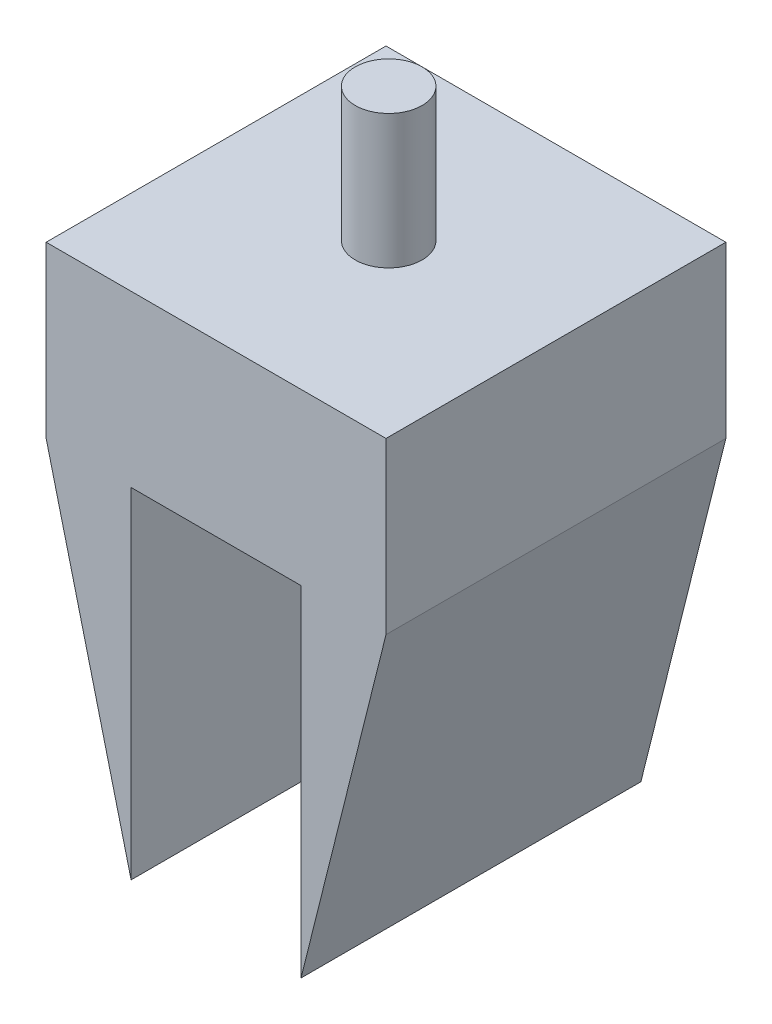
ISO-10303-21;
HEADER;
FILE_DESCRIPTION(('STEP AP214'),'2;1');
FILE_NAME('part.step','',(''),(''),'','','');
FILE_SCHEMA(('AUTOMOTIVE_DESIGN { 1 0 10303 214 1 1 1 1 }'));
ENDSEC;
DATA;
#1=APPLICATION_CONTEXT('core data for automotive mechanical design processes');
#2=APPLICATION_PROTOCOL_DEFINITION('international standard','automotive_design',2000,#1);
#3=PRODUCT_CONTEXT('',#1,'mechanical');
#4=PRODUCT('Part','Part','',(#3));
#5=PRODUCT_RELATED_PRODUCT_CATEGORY('part','',(#4));
#6=PRODUCT_DEFINITION_FORMATION('','',#4);
#7=PRODUCT_DEFINITION_CONTEXT('part definition',#1,'design');
#8=PRODUCT_DEFINITION('design','',#6,#7);
#9=PRODUCT_DEFINITION_SHAPE('','',#8);
#10=(LENGTH_UNIT() NAMED_UNIT(*) SI_UNIT(.MILLI.,.METRE.));
#11=(NAMED_UNIT(*) PLANE_ANGLE_UNIT() SI_UNIT($,.RADIAN.));
#12=(NAMED_UNIT(*) SI_UNIT($,.STERADIAN.) SOLID_ANGLE_UNIT());
#13=UNCERTAINTY_MEASURE_WITH_UNIT(LENGTH_MEASURE(1.E-05),#10,'distance_accuracy_value','');
#14=(GEOMETRIC_REPRESENTATION_CONTEXT(3) GLOBAL_UNCERTAINTY_ASSIGNED_CONTEXT((#13)) GLOBAL_UNIT_ASSIGNED_CONTEXT((#10,
#11,#12)) REPRESENTATION_CONTEXT('',''));
#15=CARTESIAN_POINT('',(0.,0.,0.));
#16=DIRECTION('',(0.,0.,1.));
#17=DIRECTION('',(1.,0.,0.));
#18=AXIS2_PLACEMENT_3D('',#15,#16,#17);
#19=CARTESIAN_POINT('',(0.,0.,-50.8));
#20=DIRECTION('',(-1.,0.,0.));
#21=DIRECTION('',(0.,0.,1.));
#22=AXIS2_PLACEMENT_3D('',#19,#20,#21);
#23=PLANE('',#22);
#24=DIRECTION('',(0.,0.,1.));
#25=VECTOR('',#24,1.);
#26=CARTESIAN_POINT('',(0.,50.8,-63.5));
#27=LINE('',#26,#25);
#28=CARTESIAN_POINT('',(0.,50.8,-50.8));
#29=VERTEX_POINT('',#28);
#30=CARTESIAN_POINT('',(0.,50.8,0.));
#31=VERTEX_POINT('',#30);
#32=EDGE_CURVE('E185',#29,#31,#27,.T.);
#33=ORIENTED_EDGE('',*,*,#32,.T.);
#34=DIRECTION('',(0.,-1.,0.));
#35=VECTOR('',#34,1.);
#36=CARTESIAN_POINT('',(0.,0.,0.));
#37=LINE('',#36,#35);
#38=CARTESIAN_POINT('',(0.,76.2,0.));
#39=VERTEX_POINT('',#38);
#40=EDGE_CURVE('E155',#39,#31,#37,.T.);
#41=ORIENTED_EDGE('',*,*,#40,.F.);
#42=DIRECTION('',(0.,0.,1.));
#43=VECTOR('',#42,1.);
#44=CARTESIAN_POINT('',(0.,76.2,-50.8));
#45=LINE('',#44,#43);
#46=CARTESIAN_POINT('',(0.,76.2,-50.8));
#47=VERTEX_POINT('',#46);
#48=EDGE_CURVE('E11',#47,#39,#45,.T.);
#49=ORIENTED_EDGE('',*,*,#48,.F.);
#50=DIRECTION('',(0.,-1.,0.));
#51=VECTOR('',#50,1.);
#52=CARTESIAN_POINT('',(0.,0.,-50.8));
#53=LINE('',#52,#51);
#54=EDGE_CURVE('E169',#47,#29,#53,.T.);
#55=ORIENTED_EDGE('',*,*,#54,.T.);
#56=EDGE_LOOP('',(#33,#41,#49,#55));
#57=FACE_BOUND('',#56,.T.);
#58=ADVANCED_FACE('F45',(#57),#23,.T.);
#59=CARTESIAN_POINT('',(0.,76.2,-50.8));
#60=DIRECTION('',(0.,1.,0.));
#61=DIRECTION('',(0.,0.,1.));
#62=AXIS2_PLACEMENT_3D('',#59,#60,#61);
#63=PLANE('',#62);
#64=CARTESIAN_POINT('',(25.4,76.2,-25.8));
#65=DIRECTION('',(0.,1.,0.));
#66=DIRECTION('',(0.,0.,1.));
#67=AXIS2_PLACEMENT_3D('',#64,#65,#66);
#68=CIRCLE('',#67,5.);
#69=CARTESIAN_POINT('',(25.4,76.2,-20.8));
#70=VERTEX_POINT('',#69);
#71=EDGE_CURVE('E313',#70,#70,#68,.T.);
#72=ORIENTED_EDGE('',*,*,#71,.F.);
#73=EDGE_LOOP('',(#72));
#74=FACE_BOUND('',#73,.T.);
#75=DIRECTION('',(-1.,0.,0.));
#76=VECTOR('',#75,1.);
#77=CARTESIAN_POINT('',(0.,76.2,0.));
#78=LINE('',#77,#76);
#79=CARTESIAN_POINT('',(50.8,76.2,0.));
#80=VERTEX_POINT('',#79);
#81=EDGE_CURVE('E147',#80,#39,#78,.T.);
#82=ORIENTED_EDGE('',*,*,#81,.F.);
#83=DIRECTION('',(0.,0.,1.));
#84=VECTOR('',#83,1.);
#85=CARTESIAN_POINT('',(50.8,76.2,-50.8));
#86=LINE('',#85,#84);
#87=CARTESIAN_POINT('',(50.8,76.2,-50.8));
#88=VERTEX_POINT('',#87);
#89=EDGE_CURVE('E55',#88,#80,#86,.T.);
#90=ORIENTED_EDGE('',*,*,#89,.F.);
#91=DIRECTION('',(-1.,0.,0.));
#92=VECTOR('',#91,1.);
#93=CARTESIAN_POINT('',(0.,76.2,-50.8));
#94=LINE('',#93,#92);
#95=EDGE_CURVE('E174',#88,#47,#94,.T.);
#96=ORIENTED_EDGE('',*,*,#95,.T.);
#97=ORIENTED_EDGE('',*,*,#48,.T.);
#98=EDGE_LOOP('',(#82,#90,#96,#97));
#99=FACE_BOUND('',#98,.T.);
#100=ADVANCED_FACE('F206',(#74,#99),#63,.T.);
#101=CARTESIAN_POINT('',(50.8,76.2,-50.8));
#102=DIRECTION('',(1.,0.,0.));
#103=DIRECTION('',(0.,0.,-1.));
#104=AXIS2_PLACEMENT_3D('',#101,#102,#103);
#105=PLANE('',#104);
#106=DIRECTION('',(0.,0.,1.));
#107=VECTOR('',#106,1.);
#108=CARTESIAN_POINT('',(50.8,50.8,-63.5));
#109=LINE('',#108,#107);
#110=CARTESIAN_POINT('',(50.8,50.8,-50.8));
#111=VERTEX_POINT('',#110);
#112=CARTESIAN_POINT('',(50.8000000000001,50.8000000000005,0.));
#113=VERTEX_POINT('',#112);
#114=EDGE_CURVE('E63',#111,#113,#109,.T.);
#115=ORIENTED_EDGE('',*,*,#114,.F.);
#116=DIRECTION('',(0.,1.,0.));
#117=VECTOR('',#116,1.);
#118=CARTESIAN_POINT('',(50.8,76.2,-50.8));
#119=LINE('',#118,#117);
#120=EDGE_CURVE('E179',#111,#88,#119,.T.);
#121=ORIENTED_EDGE('',*,*,#120,.T.);
#122=ORIENTED_EDGE('',*,*,#89,.T.);
#123=DIRECTION('',(0.,1.,0.));
#124=VECTOR('',#123,1.);
#125=CARTESIAN_POINT('',(50.8,76.2,0.));
#126=LINE('',#125,#124);
#127=EDGE_CURVE('E143',#113,#80,#126,.T.);
#128=ORIENTED_EDGE('',*,*,#127,.F.);
#129=EDGE_LOOP('',(#115,#121,#122,#128));
#130=FACE_BOUND('',#129,.T.);
#131=ADVANCED_FACE('F203',(#130),#105,.T.);
#132=CARTESIAN_POINT('',(38.1,0.,-50.8));
#133=DIRECTION('',(-1.,0.,0.));
#134=DIRECTION('',(0.,0.,1.));
#135=AXIS2_PLACEMENT_3D('',#132,#133,#134);
#136=PLANE('',#135);
#137=DIRECTION('',(0.,-1.,0.));
#138=VECTOR('',#137,1.);
#139=CARTESIAN_POINT('',(38.1,0.,0.));
#140=LINE('',#139,#138);
#141=CARTESIAN_POINT('',(38.1,50.8,0.));
#142=VERTEX_POINT('',#141);
#143=CARTESIAN_POINT('',(38.1,0.,0.));
#144=VERTEX_POINT('',#143);
#145=EDGE_CURVE('E132',#142,#144,#140,.T.);
#146=ORIENTED_EDGE('',*,*,#145,.F.);
#147=DIRECTION('',(0.,0.,1.));
#148=VECTOR('',#147,1.);
#149=CARTESIAN_POINT('',(38.1,50.8,-50.8));
#150=LINE('',#149,#148);
#151=CARTESIAN_POINT('',(38.1,50.8,-50.8));
#152=VERTEX_POINT('',#151);
#153=EDGE_CURVE('E137',#152,#142,#150,.T.);
#154=ORIENTED_EDGE('',*,*,#153,.F.);
#155=DIRECTION('',(0.,-1.,0.));
#156=VECTOR('',#155,1.);
#157=CARTESIAN_POINT('',(38.1,0.,-50.8));
#158=LINE('',#157,#156);
#159=CARTESIAN_POINT('',(38.1,0.,-50.8));
#160=VERTEX_POINT('',#159);
#161=EDGE_CURVE('E135',#152,#160,#158,.T.);
#162=ORIENTED_EDGE('',*,*,#161,.T.);
#163=DIRECTION('',(0.,0.,1.));
#164=VECTOR('',#163,1.);
#165=CARTESIAN_POINT('',(38.1,0.,-50.8));
#166=LINE('',#165,#164);
#167=EDGE_CURVE('E120',#160,#144,#166,.T.);
#168=ORIENTED_EDGE('',*,*,#167,.T.);
#169=EDGE_LOOP('',(#146,#154,#162,#168));
#170=FACE_BOUND('',#169,.T.);
#171=ADVANCED_FACE('F131',(#170),#136,.T.);
#172=CARTESIAN_POINT('',(38.1,50.8,-50.8));
#173=DIRECTION('',(0.,-1.,0.));
#174=DIRECTION('',(0.,0.,-1.));
#175=AXIS2_PLACEMENT_3D('',#172,#173,#174);
#176=PLANE('',#175);
#177=DIRECTION('',(1.,0.,0.));
#178=VECTOR('',#177,1.);
#179=CARTESIAN_POINT('',(38.1,50.8,0.));
#180=LINE('',#179,#178);
#181=CARTESIAN_POINT('',(12.7,50.8,0.));
#182=VERTEX_POINT('',#181);
#183=EDGE_CURVE('E141',#182,#142,#180,.T.);
#184=ORIENTED_EDGE('',*,*,#183,.F.);
#185=DIRECTION('',(0.,0.,1.));
#186=VECTOR('',#185,1.);
#187=CARTESIAN_POINT('',(12.7,50.8,-50.8));
#188=LINE('',#187,#186);
#189=CARTESIAN_POINT('',(12.7,50.8,-50.8));
#190=VERTEX_POINT('',#189);
#191=EDGE_CURVE('E99',#190,#182,#188,.T.);
#192=ORIENTED_EDGE('',*,*,#191,.F.);
#193=DIRECTION('',(1.,0.,0.));
#194=VECTOR('',#193,1.);
#195=CARTESIAN_POINT('',(38.1,50.8,-50.8));
#196=LINE('',#195,#194);
#197=EDGE_CURVE('E195',#190,#152,#196,.T.);
#198=ORIENTED_EDGE('',*,*,#197,.T.);
#199=ORIENTED_EDGE('',*,*,#153,.T.);
#200=EDGE_LOOP('',(#184,#192,#198,#199));
#201=FACE_BOUND('',#200,.T.);
#202=ADVANCED_FACE('F210',(#201),#176,.T.);
#203=CARTESIAN_POINT('',(12.7,50.8,-50.8));
#204=DIRECTION('',(1.,0.,0.));
#205=DIRECTION('',(0.,0.,-1.));
#206=AXIS2_PLACEMENT_3D('',#203,#204,#205);
#207=PLANE('',#206);
#208=DIRECTION('',(0.,1.,0.));
#209=VECTOR('',#208,1.);
#210=CARTESIAN_POINT('',(12.7,50.8,0.));
#211=LINE('',#210,#209);
#212=CARTESIAN_POINT('',(12.7,0.,0.));
#213=VERTEX_POINT('',#212);
#214=EDGE_CURVE('E149',#213,#182,#211,.T.);
#215=ORIENTED_EDGE('',*,*,#214,.F.);
#216=DIRECTION('',(0.,0.,1.));
#217=VECTOR('',#216,1.);
#218=CARTESIAN_POINT('',(12.7,0.,-50.8));
#219=LINE('',#218,#217);
#220=CARTESIAN_POINT('',(12.7,0.,-50.8));
#221=VERTEX_POINT('',#220);
#222=EDGE_CURVE('E49',#221,#213,#219,.T.);
#223=ORIENTED_EDGE('',*,*,#222,.F.);
#224=DIRECTION('',(0.,1.,0.));
#225=VECTOR('',#224,1.);
#226=CARTESIAN_POINT('',(12.7,50.8,-50.8));
#227=LINE('',#226,#225);
#228=EDGE_CURVE('E158',#221,#190,#227,.T.);
#229=ORIENTED_EDGE('',*,*,#228,.T.);
#230=ORIENTED_EDGE('',*,*,#191,.T.);
#231=EDGE_LOOP('',(#215,#223,#229,#230));
#232=FACE_BOUND('',#231,.T.);
#233=ADVANCED_FACE('F47',(#232),#207,.T.);
#234=CARTESIAN_POINT('',(0.,0.,-50.8));
#235=DIRECTION('',(0.,0.,-1.));
#236=DIRECTION('',(-1.,0.,0.));
#237=AXIS2_PLACEMENT_3D('',#234,#235,#236);
#238=PLANE('',#237);
#239=DIRECTION('',(0.242535625036333,0.970142500145332,0.));
#240=VECTOR('',#239,1.);
#241=CARTESIAN_POINT('',(35.8588235294118,-8.96470588235294,-50.8));
#242=LINE('',#241,#240);
#243=EDGE_CURVE('E321',#160,#111,#242,.T.);
#244=ORIENTED_EDGE('',*,*,#243,.F.);
#245=ORIENTED_EDGE('',*,*,#161,.F.);
#246=ORIENTED_EDGE('',*,*,#197,.F.);
#247=ORIENTED_EDGE('',*,*,#228,.F.);
#248=DIRECTION('',(0.242535625036333,-0.970142500145332,0.));
#249=VECTOR('',#248,1.);
#250=CARTESIAN_POINT('',(11.9529411764706,2.98823529411765,-50.8));
#251=LINE('',#250,#249);
#252=EDGE_CURVE('E183',#29,#221,#251,.T.);
#253=ORIENTED_EDGE('',*,*,#252,.F.);
#254=ORIENTED_EDGE('',*,*,#54,.F.);
#255=ORIENTED_EDGE('',*,*,#95,.F.);
#256=ORIENTED_EDGE('',*,*,#120,.F.);
#257=EDGE_LOOP('',(#244,#245,#246,#247,#253,#254,#255,#256));
#258=FACE_BOUND('',#257,.T.);
#259=ADVANCED_FACE('F207',(#258),#238,.T.);
#260=CARTESIAN_POINT('',(0.,0.,0.));
#261=DIRECTION('',(0.,0.,-1.));
#262=DIRECTION('',(-1.,0.,0.));
#263=AXIS2_PLACEMENT_3D('',#260,#261,#262);
#264=PLANE('',#263);
#265=ORIENTED_EDGE('',*,*,#145,.T.);
#266=DIRECTION('',(-0.242535625036333,-0.970142500145332,0.));
#267=VECTOR('',#266,1.);
#268=CARTESIAN_POINT('',(50.8,50.8,0.));
#269=LINE('',#268,#267);
#270=EDGE_CURVE('E117',#113,#144,#269,.T.);
#271=ORIENTED_EDGE('',*,*,#270,.F.);
#272=ORIENTED_EDGE('',*,*,#127,.T.);
#273=ORIENTED_EDGE('',*,*,#81,.T.);
#274=ORIENTED_EDGE('',*,*,#40,.T.);
#275=DIRECTION('',(-0.242535625036333,0.970142500145332,0.));
#276=VECTOR('',#275,1.);
#277=CARTESIAN_POINT('',(0.,50.8,0.));
#278=LINE('',#277,#276);
#279=EDGE_CURVE('E189',#213,#31,#278,.T.);
#280=ORIENTED_EDGE('',*,*,#279,.F.);
#281=ORIENTED_EDGE('',*,*,#214,.T.);
#282=ORIENTED_EDGE('',*,*,#183,.T.);
#283=EDGE_LOOP('',(#265,#271,#272,#273,#274,#280,#281,#282));
#284=FACE_BOUND('',#283,.T.);
#285=ADVANCED_FACE('F139',(#284),#264,.F.);
#286=CARTESIAN_POINT('',(0.,50.8,-63.5));
#287=DIRECTION('',(0.970142500145332,0.242535625036333,0.));
#288=DIRECTION('',(-0.242535625036333,0.970142500145332,0.));
#289=AXIS2_PLACEMENT_3D('',#286,#287,#288);
#290=PLANE('',#289);
#291=ORIENTED_EDGE('',*,*,#252,.T.);
#292=ORIENTED_EDGE('',*,*,#222,.T.);
#293=ORIENTED_EDGE('',*,*,#279,.T.);
#294=ORIENTED_EDGE('',*,*,#32,.F.);
#295=EDGE_LOOP('',(#291,#292,#293,#294));
#296=FACE_BOUND('',#295,.T.);
#297=ADVANCED_FACE('F246',(#296),#290,.F.);
#298=CARTESIAN_POINT('',(50.8,50.8,-63.5));
#299=DIRECTION('',(-0.970142500145332,0.242535625036333,0.));
#300=DIRECTION('',(-0.242535625036333,-0.970142500145332,0.));
#301=AXIS2_PLACEMENT_3D('',#298,#299,#300);
#302=PLANE('',#301);
#303=ORIENTED_EDGE('',*,*,#243,.T.);
#304=ORIENTED_EDGE('',*,*,#114,.T.);
#305=ORIENTED_EDGE('',*,*,#270,.T.);
#306=ORIENTED_EDGE('',*,*,#167,.F.);
#307=EDGE_LOOP('',(#303,#304,#305,#306));
#308=FACE_BOUND('',#307,.T.);
#309=ADVANCED_FACE('F119',(#308),#302,.F.);
#310=CARTESIAN_POINT('',(25.4,96.2,-25.8));
#311=DIRECTION('',(0.,-1.,0.));
#312=DIRECTION('',(0.,0.,-1.));
#313=AXIS2_PLACEMENT_3D('',#310,#311,#312);
#314=CYLINDRICAL_SURFACE('',#313,5.);
#315=CARTESIAN_POINT('',(25.4,96.2,-25.8));
#316=DIRECTION('',(0.,1.,0.));
#317=DIRECTION('',(0.,0.,1.));
#318=AXIS2_PLACEMENT_3D('',#315,#316,#317);
#319=CIRCLE('',#318,5.);
#320=CARTESIAN_POINT('',(25.4,96.2,-20.8));
#321=VERTEX_POINT('',#320);
#322=EDGE_CURVE('E126',#321,#321,#319,.T.);
#323=ORIENTED_EDGE('',*,*,#322,.F.);
#324=EDGE_LOOP('',(#323));
#325=FACE_BOUND('',#324,.T.);
#326=ORIENTED_EDGE('',*,*,#71,.T.);
#327=EDGE_LOOP('',(#326));
#328=FACE_BOUND('',#327,.T.);
#329=ADVANCED_FACE('F253',(#325,#328),#314,.T.);
#330=CARTESIAN_POINT('',(25.4,96.2,-25.8));
#331=DIRECTION('',(0.,1.,0.));
#332=DIRECTION('',(0.,0.,1.));
#333=AXIS2_PLACEMENT_3D('',#330,#331,#332);
#334=PLANE('',#333);
#335=ORIENTED_EDGE('',*,*,#322,.T.);
#336=EDGE_LOOP('',(#335));
#337=FACE_BOUND('',#336,.T.);
#338=ADVANCED_FACE('F267',(#337),#334,.T.);
#339=CLOSED_SHELL('',(#58,#100,#131,#171,#202,#233,#259,#285,#297,#309,#329,#338));
#340=MANIFOLD_SOLID_BREP('B2',#339);
#341=ADVANCED_BREP_SHAPE_REPRESENTATION('',(#18,#340),#14);
#342=SHAPE_DEFINITION_REPRESENTATION(#9,#341);
ENDSEC;
END-ISO-10303-21;
